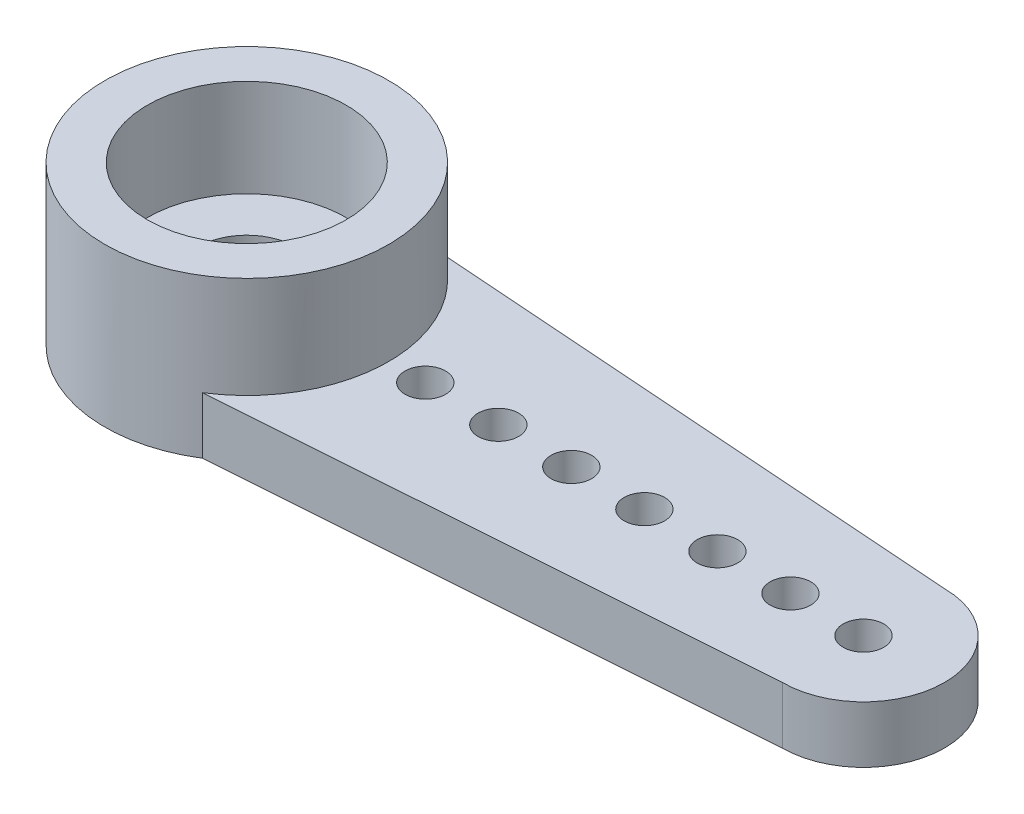
ISO-10303-21;
HEADER;
FILE_DESCRIPTION(('STEP AP214'),'2;1');
FILE_NAME('part.step','',(''),(''),'','','');
FILE_SCHEMA(('AUTOMOTIVE_DESIGN { 1 0 10303 214 1 1 1 1 }'));
ENDSEC;
DATA;
#1=APPLICATION_CONTEXT('core data for automotive mechanical design processes');
#2=APPLICATION_PROTOCOL_DEFINITION('international standard','automotive_design',2000,#1);
#3=PRODUCT_CONTEXT('',#1,'mechanical');
#4=PRODUCT('Part','Part','',(#3));
#5=PRODUCT_RELATED_PRODUCT_CATEGORY('part','',(#4));
#6=PRODUCT_DEFINITION_FORMATION('','',#4);
#7=PRODUCT_DEFINITION_CONTEXT('part definition',#1,'design');
#8=PRODUCT_DEFINITION('design','',#6,#7);
#9=PRODUCT_DEFINITION_SHAPE('','',#8);
#10=(LENGTH_UNIT() NAMED_UNIT(*) SI_UNIT(.MILLI.,.METRE.));
#11=(NAMED_UNIT(*) PLANE_ANGLE_UNIT() SI_UNIT($,.RADIAN.));
#12=(NAMED_UNIT(*) SI_UNIT($,.STERADIAN.) SOLID_ANGLE_UNIT());
#13=UNCERTAINTY_MEASURE_WITH_UNIT(LENGTH_MEASURE(1.E-05),#10,'distance_accuracy_value','');
#14=(GEOMETRIC_REPRESENTATION_CONTEXT(3) GLOBAL_UNCERTAINTY_ASSIGNED_CONTEXT((#13)) GLOBAL_UNIT_ASSIGNED_CONTEXT((#10,
#11,#12)) REPRESENTATION_CONTEXT('',''));
#15=CARTESIAN_POINT('',(0.,0.,0.));
#16=DIRECTION('',(0.,0.,1.));
#17=DIRECTION('',(1.,0.,0.));
#18=AXIS2_PLACEMENT_3D('',#15,#16,#17);
#19=CARTESIAN_POINT('',(-15.2,1.4,0.));
#20=DIRECTION('',(0.,1.,0.));
#21=DIRECTION('',(0.,0.,1.));
#22=AXIS2_PLACEMENT_3D('',#19,#20,#21);
#23=PLANE('',#22);
#24=CARTESIAN_POINT('',(6.2,1.4,0.));
#25=DIRECTION('',(0.,1.,0.));
#26=DIRECTION('',(0.,0.,1.));
#27=AXIS2_PLACEMENT_3D('',#24,#25,#26);
#28=CIRCLE('',#27,0.499999999999997);
#29=CARTESIAN_POINT('',(6.2,1.4,0.500000000000053));
#30=VERTEX_POINT('',#29);
#31=EDGE_CURVE('E130',#30,#30,#28,.T.);
#32=ORIENTED_EDGE('',*,*,#31,.F.);
#33=EDGE_LOOP('',(#32));
#34=FACE_BOUND('',#33,.T.);
#35=CARTESIAN_POINT('',(9.8,1.4,0.));
#36=DIRECTION('',(0.,1.,0.));
#37=DIRECTION('',(0.,0.,1.));
#38=AXIS2_PLACEMENT_3D('',#35,#36,#37);
#39=CIRCLE('',#38,0.499999999999997);
#40=CARTESIAN_POINT('',(9.8,1.4,0.500000000000028));
#41=VERTEX_POINT('',#40);
#42=EDGE_CURVE('E142',#41,#41,#39,.T.);
#43=ORIENTED_EDGE('',*,*,#42,.F.);
#44=EDGE_LOOP('',(#43));
#45=FACE_BOUND('',#44,.T.);
#46=CARTESIAN_POINT('',(13.4,1.4,0.));
#47=DIRECTION('',(0.,1.,0.));
#48=DIRECTION('',(0.,0.,1.));
#49=AXIS2_PLACEMENT_3D('',#46,#47,#48);
#50=CIRCLE('',#49,0.499999999999997);
#51=CARTESIAN_POINT('',(13.4,1.4,0.500000000000003));
#52=VERTEX_POINT('',#51);
#53=EDGE_CURVE('E154',#52,#52,#50,.T.);
#54=ORIENTED_EDGE('',*,*,#53,.F.);
#55=EDGE_LOOP('',(#54));
#56=FACE_BOUND('',#55,.T.);
#57=CARTESIAN_POINT('',(15.2,1.4,0.));
#58=DIRECTION('',(0.,1.,0.));
#59=DIRECTION('',(0.,0.,1.));
#60=AXIS2_PLACEMENT_3D('',#57,#58,#59);
#61=CIRCLE('',#60,0.499999999999997);
#62=CARTESIAN_POINT('',(15.2,1.4,0.49999999999999));
#63=VERTEX_POINT('',#62);
#64=EDGE_CURVE('E160',#63,#63,#61,.T.);
#65=ORIENTED_EDGE('',*,*,#64,.F.);
#66=EDGE_LOOP('',(#65));
#67=FACE_BOUND('',#66,.T.);
#68=CARTESIAN_POINT('',(11.6,1.4,0.));
#69=DIRECTION('',(0.,1.,0.));
#70=DIRECTION('',(0.,0.,1.));
#71=AXIS2_PLACEMENT_3D('',#68,#69,#70);
#72=CIRCLE('',#71,0.499999999999999);
#73=CARTESIAN_POINT('',(11.6,1.4,0.500000000000017));
#74=VERTEX_POINT('',#73);
#75=EDGE_CURVE('E148',#74,#74,#72,.T.);
#76=ORIENTED_EDGE('',*,*,#75,.F.);
#77=EDGE_LOOP('',(#76));
#78=FACE_BOUND('',#77,.T.);
#79=CARTESIAN_POINT('',(8.,1.4,0.));
#80=DIRECTION('',(0.,1.,0.));
#81=DIRECTION('',(0.,0.,1.));
#82=AXIS2_PLACEMENT_3D('',#79,#80,#81);
#83=CIRCLE('',#82,0.499999999999997);
#84=CARTESIAN_POINT('',(8.,1.4,0.500000000000041));
#85=VERTEX_POINT('',#84);
#86=EDGE_CURVE('E136',#85,#85,#83,.T.);
#87=ORIENTED_EDGE('',*,*,#86,.F.);
#88=EDGE_LOOP('',(#87));
#89=FACE_BOUND('',#88,.T.);
#90=CARTESIAN_POINT('',(4.4,1.4,0.));
#91=DIRECTION('',(0.,1.,0.));
#92=DIRECTION('',(0.,0.,1.));
#93=AXIS2_PLACEMENT_3D('',#90,#91,#92);
#94=CIRCLE('',#93,0.499999999999997);
#95=CARTESIAN_POINT('',(4.4,1.4,0.500000000000066));
#96=VERTEX_POINT('',#95);
#97=EDGE_CURVE('E124',#96,#96,#94,.T.);
#98=ORIENTED_EDGE('',*,*,#97,.F.);
#99=EDGE_LOOP('',(#98));
#100=FACE_BOUND('',#99,.T.);
#101=CARTESIAN_POINT('',(0.,1.4,0.));
#102=DIRECTION('',(0.,1.,0.));
#103=DIRECTION('',(0.,0.,1.));
#104=AXIS2_PLACEMENT_3D('',#101,#102,#103);
#105=CIRCLE('',#104,3.5);
#106=CARTESIAN_POINT('',(1.86858471289894,1.4,2.95945791838985));
#107=VERTEX_POINT('',#106);
#108=CARTESIAN_POINT('',(1.86858471289894,1.4,-2.95945791838985));
#109=VERTEX_POINT('',#108);
#110=EDGE_CURVE('E90',#107,#109,#105,.T.);
#111=ORIENTED_EDGE('',*,*,#110,.F.);
#112=DIRECTION('',(0.997420198870011,0.,-0.0717840294641297));
#113=VECTOR('',#112,1.);
#114=CARTESIAN_POINT('',(-14.9001527327747,1.4,4.16629887091939));
#115=LINE('',#114,#113);
#116=CARTESIAN_POINT('',(15.2,1.4,2.));
#117=VERTEX_POINT('',#116);
#118=EDGE_CURVE('E104',#107,#117,#115,.T.);
#119=ORIENTED_EDGE('',*,*,#118,.T.);
#120=CARTESIAN_POINT('',(15.2,1.4,0.));
#121=DIRECTION('',(0.,1.,0.));
#122=DIRECTION('',(0.,0.,-1.));
#123=AXIS2_PLACEMENT_3D('',#120,#121,#122);
#124=CIRCLE('',#123,2.);
#125=CARTESIAN_POINT('',(15.2,1.4,-2.));
#126=VERTEX_POINT('',#125);
#127=EDGE_CURVE('E166',#117,#126,#124,.T.);
#128=ORIENTED_EDGE('',*,*,#127,.T.);
#129=DIRECTION('',(-0.997420198870011,0.,-0.0717840294641295));
#130=VECTOR('',#129,1.);
#131=CARTESIAN_POINT('',(-14.9001527327747,1.4,-4.16629887091939));
#132=LINE('',#131,#130);
#133=EDGE_CURVE('E101',#126,#109,#132,.T.);
#134=ORIENTED_EDGE('',*,*,#133,.T.);
#135=EDGE_LOOP('',(#111,#119,#128,#134));
#136=FACE_BOUND('',#135,.T.);
#137=ADVANCED_FACE('F37',(#34,#45,#56,#67,#78,#89,#100,#136),#23,.T.);
#138=CARTESIAN_POINT('',(-15.2,0.,0.));
#139=DIRECTION('',(0.,1.,0.));
#140=DIRECTION('',(0.,0.,1.));
#141=AXIS2_PLACEMENT_3D('',#138,#139,#140);
#142=PLANE('',#141);
#143=CARTESIAN_POINT('',(0.,0.,0.));
#144=DIRECTION('',(0.,-1.,0.));
#145=DIRECTION('',(0.,0.,-1.));
#146=AXIS2_PLACEMENT_3D('',#143,#144,#145);
#147=CIRCLE('',#146,2.35);
#148=CARTESIAN_POINT('',(0.,0.,-2.35));
#149=VERTEX_POINT('',#148);
#150=EDGE_CURVE('E116',#149,#149,#147,.T.);
#151=ORIENTED_EDGE('',*,*,#150,.F.);
#152=EDGE_LOOP('',(#151));
#153=FACE_BOUND('',#152,.T.);
#154=CARTESIAN_POINT('',(15.2,0.,0.));
#155=DIRECTION('',(0.,1.,0.));
#156=DIRECTION('',(0.,0.,1.));
#157=AXIS2_PLACEMENT_3D('',#154,#155,#156);
#158=CIRCLE('',#157,0.499999999999997);
#159=CARTESIAN_POINT('',(15.2,0.,0.49999999999999));
#160=VERTEX_POINT('',#159);
#161=EDGE_CURVE('E157',#160,#160,#158,.T.);
#162=ORIENTED_EDGE('',*,*,#161,.T.);
#163=EDGE_LOOP('',(#162));
#164=FACE_BOUND('',#163,.T.);
#165=CARTESIAN_POINT('',(13.4,0.,0.));
#166=DIRECTION('',(0.,1.,0.));
#167=DIRECTION('',(0.,0.,1.));
#168=AXIS2_PLACEMENT_3D('',#165,#166,#167);
#169=CIRCLE('',#168,0.499999999999997);
#170=CARTESIAN_POINT('',(13.4,0.,0.500000000000003));
#171=VERTEX_POINT('',#170);
#172=EDGE_CURVE('E151',#171,#171,#169,.T.);
#173=ORIENTED_EDGE('',*,*,#172,.T.);
#174=EDGE_LOOP('',(#173));
#175=FACE_BOUND('',#174,.T.);
#176=CARTESIAN_POINT('',(11.6,0.,0.));
#177=DIRECTION('',(0.,1.,0.));
#178=DIRECTION('',(0.,0.,1.));
#179=AXIS2_PLACEMENT_3D('',#176,#177,#178);
#180=CIRCLE('',#179,0.499999999999999);
#181=CARTESIAN_POINT('',(11.6,0.,0.500000000000017));
#182=VERTEX_POINT('',#181);
#183=EDGE_CURVE('E145',#182,#182,#180,.T.);
#184=ORIENTED_EDGE('',*,*,#183,.T.);
#185=EDGE_LOOP('',(#184));
#186=FACE_BOUND('',#185,.T.);
#187=CARTESIAN_POINT('',(9.8,0.,0.));
#188=DIRECTION('',(0.,1.,0.));
#189=DIRECTION('',(0.,0.,1.));
#190=AXIS2_PLACEMENT_3D('',#187,#188,#189);
#191=CIRCLE('',#190,0.499999999999997);
#192=CARTESIAN_POINT('',(9.8,0.,0.500000000000028));
#193=VERTEX_POINT('',#192);
#194=EDGE_CURVE('E139',#193,#193,#191,.T.);
#195=ORIENTED_EDGE('',*,*,#194,.T.);
#196=EDGE_LOOP('',(#195));
#197=FACE_BOUND('',#196,.T.);
#198=CARTESIAN_POINT('',(8.,0.,0.));
#199=DIRECTION('',(0.,1.,0.));
#200=DIRECTION('',(0.,0.,1.));
#201=AXIS2_PLACEMENT_3D('',#198,#199,#200);
#202=CIRCLE('',#201,0.499999999999997);
#203=CARTESIAN_POINT('',(8.,0.,0.500000000000041));
#204=VERTEX_POINT('',#203);
#205=EDGE_CURVE('E133',#204,#204,#202,.T.);
#206=ORIENTED_EDGE('',*,*,#205,.T.);
#207=EDGE_LOOP('',(#206));
#208=FACE_BOUND('',#207,.T.);
#209=CARTESIAN_POINT('',(6.2,0.,0.));
#210=DIRECTION('',(0.,1.,0.));
#211=DIRECTION('',(0.,0.,1.));
#212=AXIS2_PLACEMENT_3D('',#209,#210,#211);
#213=CIRCLE('',#212,0.499999999999997);
#214=CARTESIAN_POINT('',(6.2,0.,0.500000000000053));
#215=VERTEX_POINT('',#214);
#216=EDGE_CURVE('E127',#215,#215,#213,.T.);
#217=ORIENTED_EDGE('',*,*,#216,.T.);
#218=EDGE_LOOP('',(#217));
#219=FACE_BOUND('',#218,.T.);
#220=CARTESIAN_POINT('',(4.4,0.,0.));
#221=DIRECTION('',(0.,1.,0.));
#222=DIRECTION('',(0.,0.,1.));
#223=AXIS2_PLACEMENT_3D('',#220,#221,#222);
#224=CIRCLE('',#223,0.499999999999997);
#225=CARTESIAN_POINT('',(4.4,0.,0.500000000000066));
#226=VERTEX_POINT('',#225);
#227=EDGE_CURVE('E121',#226,#226,#224,.T.);
#228=ORIENTED_EDGE('',*,*,#227,.T.);
#229=EDGE_LOOP('',(#228));
#230=FACE_BOUND('',#229,.T.);
#231=CARTESIAN_POINT('',(0.,0.,0.));
#232=DIRECTION('',(0.,-1.,0.));
#233=DIRECTION('',(0.,0.,-1.));
#234=AXIS2_PLACEMENT_3D('',#231,#232,#233);
#235=CIRCLE('',#234,3.5);
#236=CARTESIAN_POINT('',(1.86858471289894,0.,2.95945791838985));
#237=VERTEX_POINT('',#236);
#238=CARTESIAN_POINT('',(1.86858471289894,0.,-2.95945791838985));
#239=VERTEX_POINT('',#238);
#240=EDGE_CURVE('E75',#237,#239,#235,.T.);
#241=ORIENTED_EDGE('',*,*,#240,.T.);
#242=DIRECTION('',(0.997420198870011,0.,0.0717840294641295));
#243=VECTOR('',#242,1.);
#244=CARTESIAN_POINT('',(1.86858471289894,0.,-2.95945791838985));
#245=LINE('',#244,#243);
#246=CARTESIAN_POINT('',(15.2,0.,-2.));
#247=VERTEX_POINT('',#246);
#248=EDGE_CURVE('E80',#239,#247,#245,.T.);
#249=ORIENTED_EDGE('',*,*,#248,.T.);
#250=CARTESIAN_POINT('',(15.2,0.,0.));
#251=DIRECTION('',(0.,1.,0.));
#252=DIRECTION('',(0.,0.,-1.));
#253=AXIS2_PLACEMENT_3D('',#250,#251,#252);
#254=CIRCLE('',#253,2.);
#255=CARTESIAN_POINT('',(15.2,0.,1.99999999999999));
#256=VERTEX_POINT('',#255);
#257=EDGE_CURVE('E163',#256,#247,#254,.T.);
#258=ORIENTED_EDGE('',*,*,#257,.F.);
#259=DIRECTION('',(-0.997420198870011,0.,0.0717840294641296));
#260=VECTOR('',#259,1.);
#261=CARTESIAN_POINT('',(15.2,0.,2.));
#262=LINE('',#261,#260);
#263=EDGE_CURVE('E52',#256,#237,#262,.T.);
#264=ORIENTED_EDGE('',*,*,#263,.T.);
#265=EDGE_LOOP('',(#241,#249,#258,#264));
#266=FACE_BOUND('',#265,.T.);
#267=ADVANCED_FACE('F77',(#153,#164,#175,#186,#197,#208,#219,#230,#266),#142,.F.);
#268=CARTESIAN_POINT('',(15.2,1.4,0.));
#269=DIRECTION('',(0.,-1.,0.));
#270=DIRECTION('',(0.,0.,-1.));
#271=AXIS2_PLACEMENT_3D('',#268,#269,#270);
#272=CYLINDRICAL_SURFACE('',#271,2.);
#273=ORIENTED_EDGE('',*,*,#257,.T.);
#274=DIRECTION('',(0.,-1.,0.));
#275=VECTOR('',#274,1.);
#276=CARTESIAN_POINT('',(15.2,1.4,-2.00000000000001));
#277=LINE('',#276,#275);
#278=EDGE_CURVE('E97',#126,#247,#277,.T.);
#279=ORIENTED_EDGE('',*,*,#278,.F.);
#280=ORIENTED_EDGE('',*,*,#127,.F.);
#281=DIRECTION('',(0.,-1.,0.));
#282=VECTOR('',#281,1.);
#283=CARTESIAN_POINT('',(15.2,1.4,1.99999999999999));
#284=LINE('',#283,#282);
#285=EDGE_CURVE('E45',#117,#256,#284,.T.);
#286=ORIENTED_EDGE('',*,*,#285,.T.);
#287=EDGE_LOOP('',(#273,#279,#280,#286));
#288=FACE_BOUND('',#287,.T.);
#289=ADVANCED_FACE('F39',(#288),#272,.T.);
#290=CARTESIAN_POINT('',(15.2,1.4,0.));
#291=DIRECTION('',(0.,-1.,0.));
#292=DIRECTION('',(0.,0.,-1.));
#293=AXIS2_PLACEMENT_3D('',#290,#291,#292);
#294=CYLINDRICAL_SURFACE('',#293,0.499999999999997);
#295=ORIENTED_EDGE('',*,*,#64,.T.);
#296=EDGE_LOOP('',(#295));
#297=FACE_BOUND('',#296,.T.);
#298=ORIENTED_EDGE('',*,*,#161,.F.);
#299=EDGE_LOOP('',(#298));
#300=FACE_BOUND('',#299,.T.);
#301=ADVANCED_FACE('F225',(#297,#300),#294,.F.);
#302=CARTESIAN_POINT('',(13.4,1.4,0.));
#303=DIRECTION('',(0.,-1.,0.));
#304=DIRECTION('',(0.,0.,-1.));
#305=AXIS2_PLACEMENT_3D('',#302,#303,#304);
#306=CYLINDRICAL_SURFACE('',#305,0.499999999999997);
#307=ORIENTED_EDGE('',*,*,#53,.T.);
#308=EDGE_LOOP('',(#307));
#309=FACE_BOUND('',#308,.T.);
#310=ORIENTED_EDGE('',*,*,#172,.F.);
#311=EDGE_LOOP('',(#310));
#312=FACE_BOUND('',#311,.T.);
#313=ADVANCED_FACE('F228',(#309,#312),#306,.F.);
#314=CARTESIAN_POINT('',(11.6,1.4,0.));
#315=DIRECTION('',(0.,-1.,0.));
#316=DIRECTION('',(0.,0.,-1.));
#317=AXIS2_PLACEMENT_3D('',#314,#315,#316);
#318=CYLINDRICAL_SURFACE('',#317,0.499999999999999);
#319=ORIENTED_EDGE('',*,*,#75,.T.);
#320=EDGE_LOOP('',(#319));
#321=FACE_BOUND('',#320,.T.);
#322=ORIENTED_EDGE('',*,*,#183,.F.);
#323=EDGE_LOOP('',(#322));
#324=FACE_BOUND('',#323,.T.);
#325=ADVANCED_FACE('F232',(#321,#324),#318,.F.);
#326=CARTESIAN_POINT('',(9.8,1.4,0.));
#327=DIRECTION('',(0.,-1.,0.));
#328=DIRECTION('',(0.,0.,-1.));
#329=AXIS2_PLACEMENT_3D('',#326,#327,#328);
#330=CYLINDRICAL_SURFACE('',#329,0.499999999999997);
#331=ORIENTED_EDGE('',*,*,#42,.T.);
#332=EDGE_LOOP('',(#331));
#333=FACE_BOUND('',#332,.T.);
#334=ORIENTED_EDGE('',*,*,#194,.F.);
#335=EDGE_LOOP('',(#334));
#336=FACE_BOUND('',#335,.T.);
#337=ADVANCED_FACE('F236',(#333,#336),#330,.F.);
#338=CARTESIAN_POINT('',(8.,1.4,0.));
#339=DIRECTION('',(0.,-1.,0.));
#340=DIRECTION('',(0.,0.,-1.));
#341=AXIS2_PLACEMENT_3D('',#338,#339,#340);
#342=CYLINDRICAL_SURFACE('',#341,0.499999999999997);
#343=ORIENTED_EDGE('',*,*,#86,.T.);
#344=EDGE_LOOP('',(#343));
#345=FACE_BOUND('',#344,.T.);
#346=ORIENTED_EDGE('',*,*,#205,.F.);
#347=EDGE_LOOP('',(#346));
#348=FACE_BOUND('',#347,.T.);
#349=ADVANCED_FACE('F214',(#345,#348),#342,.F.);
#350=CARTESIAN_POINT('',(6.2,1.4,0.));
#351=DIRECTION('',(0.,-1.,0.));
#352=DIRECTION('',(0.,0.,-1.));
#353=AXIS2_PLACEMENT_3D('',#350,#351,#352);
#354=CYLINDRICAL_SURFACE('',#353,0.499999999999997);
#355=ORIENTED_EDGE('',*,*,#31,.T.);
#356=EDGE_LOOP('',(#355));
#357=FACE_BOUND('',#356,.T.);
#358=ORIENTED_EDGE('',*,*,#216,.F.);
#359=EDGE_LOOP('',(#358));
#360=FACE_BOUND('',#359,.T.);
#361=ADVANCED_FACE('F208',(#357,#360),#354,.F.);
#362=CARTESIAN_POINT('',(4.4,1.4,0.));
#363=DIRECTION('',(0.,-1.,0.));
#364=DIRECTION('',(0.,0.,-1.));
#365=AXIS2_PLACEMENT_3D('',#362,#363,#364);
#366=CYLINDRICAL_SURFACE('',#365,0.499999999999997);
#367=ORIENTED_EDGE('',*,*,#97,.T.);
#368=EDGE_LOOP('',(#367));
#369=FACE_BOUND('',#368,.T.);
#370=ORIENTED_EDGE('',*,*,#227,.F.);
#371=EDGE_LOOP('',(#370));
#372=FACE_BOUND('',#371,.T.);
#373=ADVANCED_FACE('F187',(#369,#372),#366,.F.);
#374=CARTESIAN_POINT('',(0.,1.,0.));
#375=DIRECTION('',(0.,-1.,0.));
#376=DIRECTION('',(0.,0.,-1.));
#377=AXIS2_PLACEMENT_3D('',#374,#375,#376);
#378=CYLINDRICAL_SURFACE('',#377,2.35);
#379=CARTESIAN_POINT('',(0.,1.,0.));
#380=DIRECTION('',(0.,-1.,0.));
#381=DIRECTION('',(0.,0.,-1.));
#382=AXIS2_PLACEMENT_3D('',#379,#380,#381);
#383=CIRCLE('',#382,2.35);
#384=CARTESIAN_POINT('',(0.,1.,-2.35));
#385=VERTEX_POINT('',#384);
#386=EDGE_CURVE('E118',#385,#385,#383,.T.);
#387=ORIENTED_EDGE('',*,*,#386,.F.);
#388=EDGE_LOOP('',(#387));
#389=FACE_BOUND('',#388,.T.);
#390=ORIENTED_EDGE('',*,*,#150,.T.);
#391=EDGE_LOOP('',(#390));
#392=FACE_BOUND('',#391,.T.);
#393=ADVANCED_FACE('F181',(#389,#392),#378,.F.);
#394=CARTESIAN_POINT('',(0.,1.,0.));
#395=DIRECTION('',(0.,-1.,0.));
#396=DIRECTION('',(0.,0.,-1.));
#397=AXIS2_PLACEMENT_3D('',#394,#395,#396);
#398=PLANE('',#397);
#399=CARTESIAN_POINT('',(0.,1.,0.));
#400=DIRECTION('',(0.,-1.,0.));
#401=DIRECTION('',(0.,0.,-1.));
#402=AXIS2_PLACEMENT_3D('',#399,#400,#401);
#403=CIRCLE('',#402,1.2);
#404=CARTESIAN_POINT('',(0.,1.,-1.2));
#405=VERTEX_POINT('',#404);
#406=EDGE_CURVE('E109',#405,#405,#403,.T.);
#407=ORIENTED_EDGE('',*,*,#406,.F.);
#408=EDGE_LOOP('',(#407));
#409=FACE_BOUND('',#408,.T.);
#410=ORIENTED_EDGE('',*,*,#386,.T.);
#411=EDGE_LOOP('',(#410));
#412=FACE_BOUND('',#411,.T.);
#413=ADVANCED_FACE('F177',(#409,#412),#398,.T.);
#414=CARTESIAN_POINT('',(0.,3.9,0.));
#415=DIRECTION('',(0.,1.,0.));
#416=DIRECTION('',(0.,0.,1.));
#417=AXIS2_PLACEMENT_3D('',#414,#415,#416);
#418=PLANE('',#417);
#419=CARTESIAN_POINT('',(0.,3.9,0.));
#420=DIRECTION('',(0.,1.,0.));
#421=DIRECTION('',(0.,0.,1.));
#422=AXIS2_PLACEMENT_3D('',#419,#420,#421);
#423=CIRCLE('',#422,3.5);
#424=CARTESIAN_POINT('',(0.,3.9,3.5));
#425=VERTEX_POINT('',#424);
#426=EDGE_CURVE('E113',#425,#425,#423,.T.);
#427=ORIENTED_EDGE('',*,*,#426,.T.);
#428=EDGE_LOOP('',(#427));
#429=FACE_BOUND('',#428,.T.);
#430=CARTESIAN_POINT('',(0.,3.9,0.));
#431=DIRECTION('',(0.,1.,0.));
#432=DIRECTION('',(0.,0.,1.));
#433=AXIS2_PLACEMENT_3D('',#430,#431,#432);
#434=CIRCLE('',#433,2.45);
#435=CARTESIAN_POINT('',(0.,3.9,2.45));
#436=VERTEX_POINT('',#435);
#437=EDGE_CURVE('E110',#436,#436,#434,.T.);
#438=ORIENTED_EDGE('',*,*,#437,.F.);
#439=EDGE_LOOP('',(#438));
#440=FACE_BOUND('',#439,.T.);
#441=ADVANCED_FACE('F180',(#429,#440),#418,.T.);
#442=CARTESIAN_POINT('',(0.,3.9,0.));
#443=DIRECTION('',(0.,-1.,0.));
#444=DIRECTION('',(0.,0.,-1.));
#445=AXIS2_PLACEMENT_3D('',#442,#443,#444);
#446=CYLINDRICAL_SURFACE('',#445,3.5);
#447=DIRECTION('',(0.,-1.,0.));
#448=VECTOR('',#447,1.);
#449=CARTESIAN_POINT('',(1.86858471289894,3.9,-2.95945791838985));
#450=LINE('',#449,#448);
#451=EDGE_CURVE('E84',#109,#239,#450,.T.);
#452=ORIENTED_EDGE('',*,*,#451,.T.);
#453=ORIENTED_EDGE('',*,*,#240,.F.);
#454=DIRECTION('',(0.,-1.,0.));
#455=VECTOR('',#454,1.);
#456=CARTESIAN_POINT('',(1.86858471289894,3.9,2.95945791838985));
#457=LINE('',#456,#455);
#458=EDGE_CURVE('E93',#107,#237,#457,.T.);
#459=ORIENTED_EDGE('',*,*,#458,.F.);
#460=ORIENTED_EDGE('',*,*,#110,.T.);
#461=EDGE_LOOP('',(#452,#453,#459,#460));
#462=FACE_BOUND('',#461,.T.);
#463=ORIENTED_EDGE('',*,*,#426,.F.);
#464=EDGE_LOOP('',(#463));
#465=FACE_BOUND('',#464,.T.);
#466=ADVANCED_FACE('F87',(#462,#465),#446,.T.);
#467=CARTESIAN_POINT('',(0.,3.9,0.));
#468=DIRECTION('',(0.,-1.,0.));
#469=DIRECTION('',(0.,0.,-1.));
#470=AXIS2_PLACEMENT_3D('',#467,#468,#469);
#471=CYLINDRICAL_SURFACE('',#470,2.45);
#472=CARTESIAN_POINT('',(0.,1.5,0.));
#473=DIRECTION('',(0.,1.,0.));
#474=DIRECTION('',(0.,0.,1.));
#475=AXIS2_PLACEMENT_3D('',#472,#473,#474);
#476=CIRCLE('',#475,2.45);
#477=CARTESIAN_POINT('',(0.,1.5,2.45));
#478=VERTEX_POINT('',#477);
#479=EDGE_CURVE('E11',#478,#478,#476,.T.);
#480=ORIENTED_EDGE('',*,*,#479,.F.);
#481=EDGE_LOOP('',(#480));
#482=FACE_BOUND('',#481,.T.);
#483=ORIENTED_EDGE('',*,*,#437,.T.);
#484=EDGE_LOOP('',(#483));
#485=FACE_BOUND('',#484,.T.);
#486=ADVANCED_FACE('F324',(#482,#485),#471,.F.);
#487=CARTESIAN_POINT('',(0.,0.,0.));
#488=DIRECTION('',(0.,1.,0.));
#489=DIRECTION('',(0.,0.,1.));
#490=AXIS2_PLACEMENT_3D('',#487,#488,#489);
#491=CYLINDRICAL_SURFACE('',#490,1.2);
#492=ORIENTED_EDGE('',*,*,#406,.T.);
#493=EDGE_LOOP('',(#492));
#494=FACE_BOUND('',#493,.T.);
#495=CARTESIAN_POINT('',(0.,1.5,0.));
#496=DIRECTION('',(0.,1.,0.));
#497=DIRECTION('',(0.,0.,1.));
#498=AXIS2_PLACEMENT_3D('',#495,#496,#497);
#499=CIRCLE('',#498,1.2);
#500=CARTESIAN_POINT('',(0.,1.5,1.2));
#501=VERTEX_POINT('',#500);
#502=EDGE_CURVE('E106',#501,#501,#499,.T.);
#503=ORIENTED_EDGE('',*,*,#502,.T.);
#504=EDGE_LOOP('',(#503));
#505=FACE_BOUND('',#504,.T.);
#506=ADVANCED_FACE('F174',(#494,#505),#491,.F.);
#507=CARTESIAN_POINT('',(0.,1.5,0.));
#508=DIRECTION('',(0.,1.,0.));
#509=DIRECTION('',(0.,0.,1.));
#510=AXIS2_PLACEMENT_3D('',#507,#508,#509);
#511=PLANE('',#510);
#512=ORIENTED_EDGE('',*,*,#479,.T.);
#513=EDGE_LOOP('',(#512));
#514=FACE_BOUND('',#513,.T.);
#515=ORIENTED_EDGE('',*,*,#502,.F.);
#516=EDGE_LOOP('',(#515));
#517=FACE_BOUND('',#516,.T.);
#518=ADVANCED_FACE('F310',(#514,#517),#511,.T.);
#519=CARTESIAN_POINT('',(1.86858471289894,3.9,-2.95945791838985));
#520=DIRECTION('',(0.0717840294641295,0.,-0.997420198870011));
#521=DIRECTION('',(-0.997420198870011,0.,-0.0717840294641295));
#522=AXIS2_PLACEMENT_3D('',#519,#520,#521);
#523=PLANE('',#522);
#524=ORIENTED_EDGE('',*,*,#278,.T.);
#525=ORIENTED_EDGE('',*,*,#248,.F.);
#526=ORIENTED_EDGE('',*,*,#451,.F.);
#527=ORIENTED_EDGE('',*,*,#133,.F.);
#528=EDGE_LOOP('',(#524,#525,#526,#527));
#529=FACE_BOUND('',#528,.T.);
#530=ADVANCED_FACE('F95',(#529),#523,.T.);
#531=CARTESIAN_POINT('',(15.2,3.9,2.));
#532=DIRECTION('',(0.0717840294641297,0.,0.997420198870011));
#533=DIRECTION('',(0.997420198870011,0.,-0.0717840294641297));
#534=AXIS2_PLACEMENT_3D('',#531,#532,#533);
#535=PLANE('',#534);
#536=ORIENTED_EDGE('',*,*,#458,.T.);
#537=ORIENTED_EDGE('',*,*,#263,.F.);
#538=ORIENTED_EDGE('',*,*,#285,.F.);
#539=ORIENTED_EDGE('',*,*,#118,.F.);
#540=EDGE_LOOP('',(#536,#537,#538,#539));
#541=FACE_BOUND('',#540,.T.);
#542=ADVANCED_FACE('F349',(#541),#535,.T.);
#543=CLOSED_SHELL('',(#137,#267,#289,#301,#313,#325,#337,#349,#361,#373,#393,#413,#441,#466,
#486,#506,#518,#530,#542));
#544=MANIFOLD_SOLID_BREP('B2',#543);
#545=ADVANCED_BREP_SHAPE_REPRESENTATION('',(#18,#544),#14);
#546=SHAPE_DEFINITION_REPRESENTATION(#9,#545);
ENDSEC;
END-ISO-10303-21;
